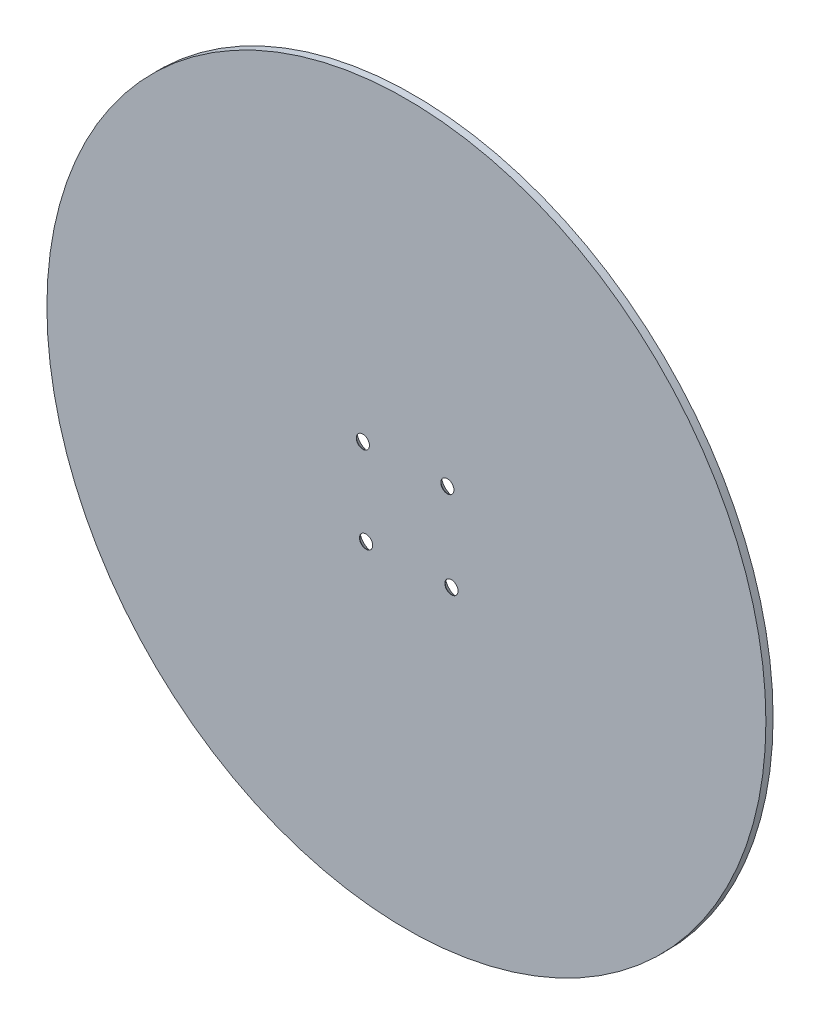
ISO-10303-21;
HEADER;
FILE_DESCRIPTION(('STEP AP214'),'2;1');
FILE_NAME('part.step','',(''),(''),'','','');
FILE_SCHEMA(('AUTOMOTIVE_DESIGN { 1 0 10303 214 1 1 1 1 }'));
ENDSEC;
DATA;
#1=APPLICATION_CONTEXT('core data for automotive mechanical design processes');
#2=APPLICATION_PROTOCOL_DEFINITION('international standard','automotive_design',2000,#1);
#3=PRODUCT_CONTEXT('',#1,'mechanical');
#4=PRODUCT('Part','Part','',(#3));
#5=PRODUCT_RELATED_PRODUCT_CATEGORY('part','',(#4));
#6=PRODUCT_DEFINITION_FORMATION('','',#4);
#7=PRODUCT_DEFINITION_CONTEXT('part definition',#1,'design');
#8=PRODUCT_DEFINITION('design','',#6,#7);
#9=PRODUCT_DEFINITION_SHAPE('','',#8);
#10=(LENGTH_UNIT() NAMED_UNIT(*) SI_UNIT(.MILLI.,.METRE.));
#11=(NAMED_UNIT(*) PLANE_ANGLE_UNIT() SI_UNIT($,.RADIAN.));
#12=(NAMED_UNIT(*) SI_UNIT($,.STERADIAN.) SOLID_ANGLE_UNIT());
#13=UNCERTAINTY_MEASURE_WITH_UNIT(LENGTH_MEASURE(1.E-05),#10,'distance_accuracy_value','');
#14=(GEOMETRIC_REPRESENTATION_CONTEXT(3) GLOBAL_UNCERTAINTY_ASSIGNED_CONTEXT((#13)) GLOBAL_UNIT_ASSIGNED_CONTEXT((#10,
#11,#12)) REPRESENTATION_CONTEXT('',''));
#15=CARTESIAN_POINT('',(0.,0.,0.));
#16=DIRECTION('',(0.,0.,1.));
#17=DIRECTION('',(1.,0.,0.));
#18=AXIS2_PLACEMENT_3D('',#15,#16,#17);
#19=CARTESIAN_POINT('',(0.,0.,3.));
#20=DIRECTION('',(0.,0.,-1.));
#21=DIRECTION('',(-1.,0.,0.));
#22=AXIS2_PLACEMENT_3D('',#19,#20,#21);
#23=CYLINDRICAL_SURFACE('',#22,150.);
#24=CARTESIAN_POINT('',(0.,0.,3.));
#25=DIRECTION('',(0.,0.,1.));
#26=DIRECTION('',(1.,0.,0.));
#27=AXIS2_PLACEMENT_3D('',#24,#25,#26);
#28=CIRCLE('',#27,150.);
#29=CARTESIAN_POINT('',(150.,0.,3.));
#30=VERTEX_POINT('',#29);
#31=EDGE_CURVE('E10',#30,#30,#28,.T.);
#32=ORIENTED_EDGE('',*,*,#31,.F.);
#33=EDGE_LOOP('',(#32));
#34=FACE_BOUND('',#33,.T.);
#35=CARTESIAN_POINT('',(0.,0.,0.));
#36=DIRECTION('',(0.,0.,1.));
#37=DIRECTION('',(1.,0.,0.));
#38=AXIS2_PLACEMENT_3D('',#35,#36,#37);
#39=CIRCLE('',#38,150.);
#40=CARTESIAN_POINT('',(150.,0.,0.));
#41=VERTEX_POINT('',#40);
#42=EDGE_CURVE('E40',#41,#41,#39,.T.);
#43=ORIENTED_EDGE('',*,*,#42,.T.);
#44=EDGE_LOOP('',(#43));
#45=FACE_BOUND('',#44,.T.);
#46=ADVANCED_FACE('F37',(#34,#45),#23,.T.);
#47=CARTESIAN_POINT('',(0.,0.,3.));
#48=DIRECTION('',(0.,0.,1.));
#49=DIRECTION('',(1.,0.,0.));
#50=AXIS2_PLACEMENT_3D('',#47,#48,#49);
#51=PLANE('',#50);
#52=CARTESIAN_POINT('',(17.0807660506948,18.5869871977332,3.));
#53=DIRECTION('',(0.,0.,-1.));
#54=DIRECTION('',(-1.,0.,0.));
#55=AXIS2_PLACEMENT_3D('',#52,#53,#54);
#56=CIRCLE('',#55,2.75);
#57=CARTESIAN_POINT('',(14.3307660506948,18.5869871977332,3.));
#58=VERTEX_POINT('',#57);
#59=EDGE_CURVE('E75',#58,#58,#56,.T.);
#60=ORIENTED_EDGE('',*,*,#59,.T.);
#61=EDGE_LOOP('',(#60));
#62=FACE_BOUND('',#61,.T.);
#63=CARTESIAN_POINT('',(-18.1755827566016,17.0623883303907,3.));
#64=DIRECTION('',(0.,0.,-1.));
#65=DIRECTION('',(-1.,0.,0.));
#66=AXIS2_PLACEMENT_3D('',#63,#64,#65);
#67=CIRCLE('',#66,2.75);
#68=CARTESIAN_POINT('',(-20.9255827566016,17.0623883303907,3.));
#69=VERTEX_POINT('',#68);
#70=EDGE_CURVE('E66',#69,#69,#67,.T.);
#71=ORIENTED_EDGE('',*,*,#70,.T.);
#72=EDGE_LOOP('',(#71));
#73=FACE_BOUND('',#72,.T.);
#74=CARTESIAN_POINT('',(-16.8415587476769,-18.3845353353236,3.));
#75=DIRECTION('',(0.,0.,-1.));
#76=DIRECTION('',(-1.,0.,0.));
#77=AXIS2_PLACEMENT_3D('',#74,#75,#76);
#78=CIRCLE('',#77,2.75);
#79=CARTESIAN_POINT('',(-19.5915587476769,-18.3845353353236,3.));
#80=VERTEX_POINT('',#79);
#81=EDGE_CURVE('E57',#80,#80,#78,.T.);
#82=ORIENTED_EDGE('',*,*,#81,.T.);
#83=EDGE_LOOP('',(#82));
#84=FACE_BOUND('',#83,.T.);
#85=CARTESIAN_POINT('',(18.7959397764551,-17.0505113263988,3.));
#86=DIRECTION('',(0.,0.,-1.));
#87=DIRECTION('',(-1.,0.,0.));
#88=AXIS2_PLACEMENT_3D('',#85,#86,#87);
#89=CIRCLE('',#88,2.75);
#90=CARTESIAN_POINT('',(16.0459397764551,-17.0505113263988,3.));
#91=VERTEX_POINT('',#90);
#92=EDGE_CURVE('E47',#91,#91,#89,.T.);
#93=ORIENTED_EDGE('',*,*,#92,.T.);
#94=EDGE_LOOP('',(#93));
#95=FACE_BOUND('',#94,.T.);
#96=ORIENTED_EDGE('',*,*,#31,.T.);
#97=EDGE_LOOP('',(#96));
#98=FACE_BOUND('',#97,.T.);
#99=ADVANCED_FACE('F91',(#62,#73,#84,#95,#98),#51,.T.);
#100=CARTESIAN_POINT('',(0.,0.,0.));
#101=DIRECTION('',(0.,0.,1.));
#102=DIRECTION('',(1.,0.,0.));
#103=AXIS2_PLACEMENT_3D('',#100,#101,#102);
#104=PLANE('',#103);
#105=CARTESIAN_POINT('',(17.0807660506948,18.5869871977332,0.));
#106=DIRECTION('',(0.,0.,-1.));
#107=DIRECTION('',(-1.,0.,0.));
#108=AXIS2_PLACEMENT_3D('',#105,#106,#107);
#109=CIRCLE('',#108,5.6);
#110=CARTESIAN_POINT('',(11.4807660506948,18.5869871977332,0.));
#111=VERTEX_POINT('',#110);
#112=EDGE_CURVE('E81',#111,#111,#109,.T.);
#113=ORIENTED_EDGE('',*,*,#112,.F.);
#114=EDGE_LOOP('',(#113));
#115=FACE_BOUND('',#114,.T.);
#116=CARTESIAN_POINT('',(-18.1755827566016,17.0623883303907,0.));
#117=DIRECTION('',(0.,0.,-1.));
#118=DIRECTION('',(-1.,0.,0.));
#119=AXIS2_PLACEMENT_3D('',#116,#117,#118);
#120=CIRCLE('',#119,5.6);
#121=CARTESIAN_POINT('',(-23.7755827566016,17.0623883303907,0.));
#122=VERTEX_POINT('',#121);
#123=EDGE_CURVE('E72',#122,#122,#120,.T.);
#124=ORIENTED_EDGE('',*,*,#123,.F.);
#125=EDGE_LOOP('',(#124));
#126=FACE_BOUND('',#125,.T.);
#127=CARTESIAN_POINT('',(-16.8415587476769,-18.3845353353236,0.));
#128=DIRECTION('',(0.,0.,-1.));
#129=DIRECTION('',(-1.,0.,0.));
#130=AXIS2_PLACEMENT_3D('',#127,#128,#129);
#131=CIRCLE('',#130,5.6);
#132=CARTESIAN_POINT('',(-22.4415587476769,-18.3845353353236,0.));
#133=VERTEX_POINT('',#132);
#134=EDGE_CURVE('E63',#133,#133,#131,.T.);
#135=ORIENTED_EDGE('',*,*,#134,.F.);
#136=EDGE_LOOP('',(#135));
#137=FACE_BOUND('',#136,.T.);
#138=CARTESIAN_POINT('',(18.7959397764551,-17.0505113263988,0.));
#139=DIRECTION('',(0.,0.,-1.));
#140=DIRECTION('',(-1.,0.,0.));
#141=AXIS2_PLACEMENT_3D('',#138,#139,#140);
#142=CIRCLE('',#141,5.6);
#143=CARTESIAN_POINT('',(13.1959397764551,-17.0505113263988,0.));
#144=VERTEX_POINT('',#143);
#145=EDGE_CURVE('E54',#144,#144,#142,.T.);
#146=ORIENTED_EDGE('',*,*,#145,.F.);
#147=EDGE_LOOP('',(#146));
#148=FACE_BOUND('',#147,.T.);
#149=ORIENTED_EDGE('',*,*,#42,.F.);
#150=EDGE_LOOP('',(#149));
#151=FACE_BOUND('',#150,.T.);
#152=ADVANCED_FACE('F87',(#115,#126,#137,#148,#151),#104,.F.);
#153=CARTESIAN_POINT('',(18.7959397764551,-17.0505113263988,0.));
#154=DIRECTION('',(0.,0.,-1.));
#155=DIRECTION('',(-1.,0.,0.));
#156=AXIS2_PLACEMENT_3D('',#153,#154,#155);
#157=CYLINDRICAL_SURFACE('',#156,2.75);
#158=ORIENTED_EDGE('',*,*,#92,.F.);
#159=EDGE_LOOP('',(#158));
#160=FACE_BOUND('',#159,.T.);
#161=CARTESIAN_POINT('',(18.7959397764551,-17.0505113263988,2.85));
#162=DIRECTION('',(0.,0.,-1.));
#163=DIRECTION('',(-1.,0.,0.));
#164=AXIS2_PLACEMENT_3D('',#161,#162,#163);
#165=CIRCLE('',#164,2.75);
#166=CARTESIAN_POINT('',(16.0459397764551,-17.0505113263988,2.85));
#167=VERTEX_POINT('',#166);
#168=EDGE_CURVE('E51',#167,#167,#165,.T.);
#169=ORIENTED_EDGE('',*,*,#168,.T.);
#170=EDGE_LOOP('',(#169));
#171=FACE_BOUND('',#170,.T.);
#172=ADVANCED_FACE('F90',(#160,#171),#157,.F.);
#173=CARTESIAN_POINT('',(18.7959397764551,-17.0505113263988,0.));
#174=DIRECTION('',(0.,0.,-1.));
#175=DIRECTION('',(-1.,0.,0.));
#176=AXIS2_PLACEMENT_3D('',#173,#174,#175);
#177=CONICAL_SURFACE('',#176,5.6,0.785398163397448);
#178=ORIENTED_EDGE('',*,*,#168,.F.);
#179=EDGE_LOOP('',(#178));
#180=FACE_BOUND('',#179,.T.);
#181=ORIENTED_EDGE('',*,*,#145,.T.);
#182=EDGE_LOOP('',(#181));
#183=FACE_BOUND('',#182,.T.);
#184=ADVANCED_FACE('F113',(#180,#183),#177,.F.);
#185=CARTESIAN_POINT('',(-16.8415587476769,-18.3845353353236,0.));
#186=DIRECTION('',(0.,0.,-1.));
#187=DIRECTION('',(-1.,0.,0.));
#188=AXIS2_PLACEMENT_3D('',#185,#186,#187);
#189=CYLINDRICAL_SURFACE('',#188,2.75);
#190=ORIENTED_EDGE('',*,*,#81,.F.);
#191=EDGE_LOOP('',(#190));
#192=FACE_BOUND('',#191,.T.);
#193=CARTESIAN_POINT('',(-16.8415587476769,-18.3845353353236,2.85));
#194=DIRECTION('',(0.,0.,-1.));
#195=DIRECTION('',(-1.,0.,0.));
#196=AXIS2_PLACEMENT_3D('',#193,#194,#195);
#197=CIRCLE('',#196,2.75);
#198=CARTESIAN_POINT('',(-19.5915587476769,-18.3845353353236,2.85));
#199=VERTEX_POINT('',#198);
#200=EDGE_CURVE('E60',#199,#199,#197,.T.);
#201=ORIENTED_EDGE('',*,*,#200,.T.);
#202=EDGE_LOOP('',(#201));
#203=FACE_BOUND('',#202,.T.);
#204=ADVANCED_FACE('F117',(#192,#203),#189,.F.);
#205=CARTESIAN_POINT('',(-16.8415587476769,-18.3845353353236,0.));
#206=DIRECTION('',(0.,0.,-1.));
#207=DIRECTION('',(-1.,0.,0.));
#208=AXIS2_PLACEMENT_3D('',#205,#206,#207);
#209=CONICAL_SURFACE('',#208,5.6,0.785398163397448);
#210=ORIENTED_EDGE('',*,*,#200,.F.);
#211=EDGE_LOOP('',(#210));
#212=FACE_BOUND('',#211,.T.);
#213=ORIENTED_EDGE('',*,*,#134,.T.);
#214=EDGE_LOOP('',(#213));
#215=FACE_BOUND('',#214,.T.);
#216=ADVANCED_FACE('F121',(#212,#215),#209,.F.);
#217=CARTESIAN_POINT('',(-18.1755827566016,17.0623883303907,0.));
#218=DIRECTION('',(0.,0.,-1.));
#219=DIRECTION('',(-1.,0.,0.));
#220=AXIS2_PLACEMENT_3D('',#217,#218,#219);
#221=CYLINDRICAL_SURFACE('',#220,2.75);
#222=ORIENTED_EDGE('',*,*,#70,.F.);
#223=EDGE_LOOP('',(#222));
#224=FACE_BOUND('',#223,.T.);
#225=CARTESIAN_POINT('',(-18.1755827566016,17.0623883303907,2.85));
#226=DIRECTION('',(0.,0.,-1.));
#227=DIRECTION('',(-1.,0.,0.));
#228=AXIS2_PLACEMENT_3D('',#225,#226,#227);
#229=CIRCLE('',#228,2.75);
#230=CARTESIAN_POINT('',(-20.9255827566016,17.0623883303907,2.85));
#231=VERTEX_POINT('',#230);
#232=EDGE_CURVE('E69',#231,#231,#229,.T.);
#233=ORIENTED_EDGE('',*,*,#232,.T.);
#234=EDGE_LOOP('',(#233));
#235=FACE_BOUND('',#234,.T.);
#236=ADVANCED_FACE('F125',(#224,#235),#221,.F.);
#237=CARTESIAN_POINT('',(-18.1755827566016,17.0623883303907,0.));
#238=DIRECTION('',(0.,0.,-1.));
#239=DIRECTION('',(-1.,0.,0.));
#240=AXIS2_PLACEMENT_3D('',#237,#238,#239);
#241=CONICAL_SURFACE('',#240,5.6,0.785398163397448);
#242=ORIENTED_EDGE('',*,*,#232,.F.);
#243=EDGE_LOOP('',(#242));
#244=FACE_BOUND('',#243,.T.);
#245=ORIENTED_EDGE('',*,*,#123,.T.);
#246=EDGE_LOOP('',(#245));
#247=FACE_BOUND('',#246,.T.);
#248=ADVANCED_FACE('F129',(#244,#247),#241,.F.);
#249=CARTESIAN_POINT('',(17.0807660506948,18.5869871977332,0.));
#250=DIRECTION('',(0.,0.,-1.));
#251=DIRECTION('',(-1.,0.,0.));
#252=AXIS2_PLACEMENT_3D('',#249,#250,#251);
#253=CYLINDRICAL_SURFACE('',#252,2.75);
#254=ORIENTED_EDGE('',*,*,#59,.F.);
#255=EDGE_LOOP('',(#254));
#256=FACE_BOUND('',#255,.T.);
#257=CARTESIAN_POINT('',(17.0807660506948,18.5869871977332,2.85));
#258=DIRECTION('',(0.,0.,-1.));
#259=DIRECTION('',(-1.,0.,0.));
#260=AXIS2_PLACEMENT_3D('',#257,#258,#259);
#261=CIRCLE('',#260,2.75);
#262=CARTESIAN_POINT('',(14.3307660506948,18.5869871977332,2.85));
#263=VERTEX_POINT('',#262);
#264=EDGE_CURVE('E78',#263,#263,#261,.T.);
#265=ORIENTED_EDGE('',*,*,#264,.T.);
#266=EDGE_LOOP('',(#265));
#267=FACE_BOUND('',#266,.T.);
#268=ADVANCED_FACE('F133',(#256,#267),#253,.F.);
#269=CARTESIAN_POINT('',(17.0807660506948,18.5869871977332,0.));
#270=DIRECTION('',(0.,0.,-1.));
#271=DIRECTION('',(-1.,0.,0.));
#272=AXIS2_PLACEMENT_3D('',#269,#270,#271);
#273=CONICAL_SURFACE('',#272,5.6,0.785398163397448);
#274=ORIENTED_EDGE('',*,*,#264,.F.);
#275=EDGE_LOOP('',(#274));
#276=FACE_BOUND('',#275,.T.);
#277=ORIENTED_EDGE('',*,*,#112,.T.);
#278=EDGE_LOOP('',(#277));
#279=FACE_BOUND('',#278,.T.);
#280=ADVANCED_FACE('F85',(#276,#279),#273,.F.);
#281=CLOSED_SHELL('',(#46,#99,#152,#172,#184,#204,#216,#236,#248,#268,#280));
#282=MANIFOLD_SOLID_BREP('B2',#281);
#283=ADVANCED_BREP_SHAPE_REPRESENTATION('',(#18,#282),#14);
#284=SHAPE_DEFINITION_REPRESENTATION(#9,#283);
ENDSEC;
END-ISO-10303-21;
